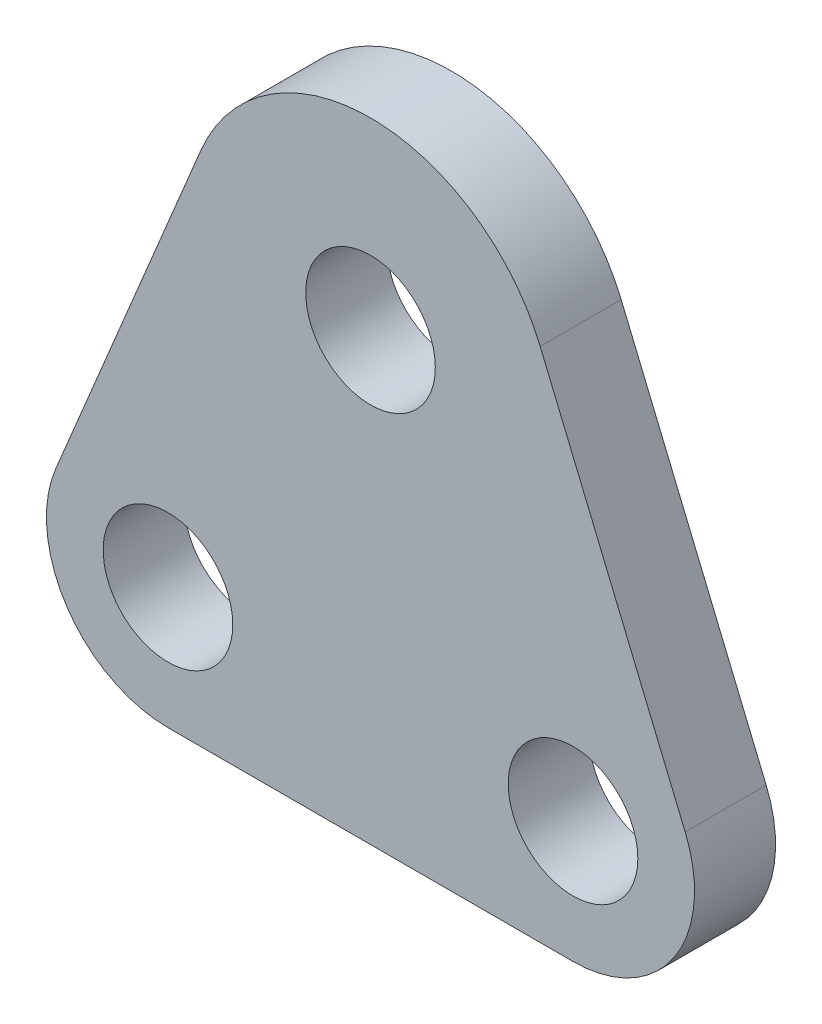
ISO-10303-21;
HEADER;
FILE_DESCRIPTION(('STEP AP214'),'2;1');
FILE_NAME('part.step','',(''),(''),'','','');
FILE_SCHEMA(('AUTOMOTIVE_DESIGN { 1 0 10303 214 1 1 1 1 }'));
ENDSEC;
DATA;
#1=APPLICATION_CONTEXT('core data for automotive mechanical design processes');
#2=APPLICATION_PROTOCOL_DEFINITION('international standard','automotive_design',2000,#1);
#3=PRODUCT_CONTEXT('',#1,'mechanical');
#4=PRODUCT('Part','Part','',(#3));
#5=PRODUCT_RELATED_PRODUCT_CATEGORY('part','',(#4));
#6=PRODUCT_DEFINITION_FORMATION('','',#4);
#7=PRODUCT_DEFINITION_CONTEXT('part definition',#1,'design');
#8=PRODUCT_DEFINITION('design','',#6,#7);
#9=PRODUCT_DEFINITION_SHAPE('','',#8);
#10=(LENGTH_UNIT() NAMED_UNIT(*) SI_UNIT(.MILLI.,.METRE.));
#11=(NAMED_UNIT(*) PLANE_ANGLE_UNIT() SI_UNIT($,.RADIAN.));
#12=(NAMED_UNIT(*) SI_UNIT($,.STERADIAN.) SOLID_ANGLE_UNIT());
#13=UNCERTAINTY_MEASURE_WITH_UNIT(LENGTH_MEASURE(1.E-05),#10,'distance_accuracy_value','');
#14=(GEOMETRIC_REPRESENTATION_CONTEXT(3) GLOBAL_UNCERTAINTY_ASSIGNED_CONTEXT((#13)) GLOBAL_UNIT_ASSIGNED_CONTEXT((#10,
#11,#12)) REPRESENTATION_CONTEXT('',''));
#15=CARTESIAN_POINT('',(0.,0.,0.));
#16=DIRECTION('',(0.,0.,1.));
#17=DIRECTION('',(1.,0.,0.));
#18=AXIS2_PLACEMENT_3D('',#15,#16,#17);
#19=CARTESIAN_POINT('',(-2.76923086674543,1.15384591981093,2.));
#20=DIRECTION('',(0.923076955581812,-0.384615306603643,0.));
#21=DIRECTION('',(0.384615306603643,0.923076955581812,0.));
#22=AXIS2_PLACEMENT_3D('',#19,#20,#21);
#23=PLANE('',#22);
#24=DIRECTION('',(-0.384615306603643,-0.923076955581812,0.));
#25=VECTOR('',#24,1.);
#26=CARTESIAN_POINT('',(-2.76923086674543,1.15384591981093,0.));
#27=LINE('',#26,#25);
#28=CARTESIAN_POINT('',(0.810649863919962,9.74556171861556,0.));
#29=VERTEX_POINT('',#28);
#30=CARTESIAN_POINT('',(-2.76923086674543,1.15384591981093,0.));
#31=VERTEX_POINT('',#30);
#32=EDGE_CURVE('E129',#29,#31,#27,.T.);
#33=ORIENTED_EDGE('',*,*,#32,.T.);
#34=DIRECTION('',(0.,0.,-1.));
#35=VECTOR('',#34,1.);
#36=CARTESIAN_POINT('',(-2.76923086674543,1.15384591981093,2.));
#37=LINE('',#36,#35);
#38=CARTESIAN_POINT('',(-2.76923086674543,1.15384591981093,2.));
#39=VERTEX_POINT('',#38);
#40=EDGE_CURVE('E11',#39,#31,#37,.T.);
#41=ORIENTED_EDGE('',*,*,#40,.F.);
#42=DIRECTION('',(-0.384615306603643,-0.923076955581812,0.));
#43=VECTOR('',#42,1.);
#44=CARTESIAN_POINT('',(-2.76923086674543,1.15384591981093,2.));
#45=LINE('',#44,#43);
#46=CARTESIAN_POINT('',(0.810649863919962,9.74556171861556,2.));
#47=VERTEX_POINT('',#46);
#48=EDGE_CURVE('E153',#47,#39,#45,.T.);
#49=ORIENTED_EDGE('',*,*,#48,.F.);
#50=DIRECTION('',(0.,0.,-1.));
#51=VECTOR('',#50,1.);
#52=CARTESIAN_POINT('',(0.810649863919962,9.74556171861556,2.));
#53=LINE('',#52,#51);
#54=EDGE_CURVE('E116',#47,#29,#53,.T.);
#55=ORIENTED_EDGE('',*,*,#54,.T.);
#56=EDGE_LOOP('',(#33,#41,#49,#55));
#57=FACE_BOUND('',#56,.T.);
#58=ADVANCED_FACE('F36',(#57),#23,.F.);
#59=CARTESIAN_POINT('',(0.,0.,2.));
#60=DIRECTION('',(0.,0.,-1.));
#61=DIRECTION('',(-1.,0.,0.));
#62=AXIS2_PLACEMENT_3D('',#59,#60,#61);
#63=CYLINDRICAL_SURFACE('',#62,3.);
#64=CARTESIAN_POINT('',(0.,0.,0.));
#65=DIRECTION('',(0.,0.,1.));
#66=DIRECTION('',(1.,0.,0.));
#67=AXIS2_PLACEMENT_3D('',#64,#65,#66);
#68=CIRCLE('',#67,3.);
#69=CARTESIAN_POINT('',(0.,-3.,0.));
#70=VERTEX_POINT('',#69);
#71=EDGE_CURVE('E132',#31,#70,#68,.T.);
#72=ORIENTED_EDGE('',*,*,#71,.T.);
#73=DIRECTION('',(0.,0.,-1.));
#74=VECTOR('',#73,1.);
#75=CARTESIAN_POINT('',(0.,-3.,2.));
#76=LINE('',#75,#74);
#77=CARTESIAN_POINT('',(0.,-3.,2.));
#78=VERTEX_POINT('',#77);
#79=EDGE_CURVE('E45',#78,#70,#76,.T.);
#80=ORIENTED_EDGE('',*,*,#79,.F.);
#81=CARTESIAN_POINT('',(0.,0.,2.));
#82=DIRECTION('',(0.,0.,1.));
#83=DIRECTION('',(1.,0.,0.));
#84=AXIS2_PLACEMENT_3D('',#81,#82,#83);
#85=CIRCLE('',#84,3.);
#86=EDGE_CURVE('E86',#39,#78,#85,.T.);
#87=ORIENTED_EDGE('',*,*,#86,.F.);
#88=ORIENTED_EDGE('',*,*,#40,.T.);
#89=EDGE_LOOP('',(#72,#80,#87,#88));
#90=FACE_BOUND('',#89,.T.);
#91=ADVANCED_FACE('F168',(#90),#63,.T.);
#92=CARTESIAN_POINT('',(0.,-3.,2.));
#93=DIRECTION('',(0.,1.,0.));
#94=DIRECTION('',(0.,0.,1.));
#95=AXIS2_PLACEMENT_3D('',#92,#93,#94);
#96=PLANE('',#95);
#97=DIRECTION('',(1.,0.,0.));
#98=VECTOR('',#97,1.);
#99=CARTESIAN_POINT('',(0.,-3.,0.));
#100=LINE('',#99,#98);
#101=CARTESIAN_POINT('',(9.99999797169469,-3.,0.));
#102=VERTEX_POINT('',#101);
#103=EDGE_CURVE('E134',#70,#102,#100,.T.);
#104=ORIENTED_EDGE('',*,*,#103,.T.);
#105=DIRECTION('',(0.,0.,-1.));
#106=VECTOR('',#105,1.);
#107=CARTESIAN_POINT('',(9.99999797169469,-3.,2.));
#108=LINE('',#107,#106);
#109=CARTESIAN_POINT('',(9.99999797169469,-3.,2.));
#110=VERTEX_POINT('',#109);
#111=EDGE_CURVE('E112',#110,#102,#108,.T.);
#112=ORIENTED_EDGE('',*,*,#111,.F.);
#113=DIRECTION('',(1.,0.,0.));
#114=VECTOR('',#113,1.);
#115=CARTESIAN_POINT('',(0.,-3.,2.));
#116=LINE('',#115,#114);
#117=EDGE_CURVE('E99',#78,#110,#116,.T.);
#118=ORIENTED_EDGE('',*,*,#117,.F.);
#119=ORIENTED_EDGE('',*,*,#79,.T.);
#120=EDGE_LOOP('',(#104,#112,#118,#119));
#121=FACE_BOUND('',#120,.T.);
#122=ADVANCED_FACE('F146',(#121),#96,.F.);
#123=CARTESIAN_POINT('',(9.99999797169469,0.,2.));
#124=DIRECTION('',(0.,0.,-1.));
#125=DIRECTION('',(-1.,0.,0.));
#126=AXIS2_PLACEMENT_3D('',#123,#124,#125);
#127=CYLINDRICAL_SURFACE('',#126,3.);
#128=CARTESIAN_POINT('',(9.99999797169469,0.,0.));
#129=DIRECTION('',(0.,0.,1.));
#130=DIRECTION('',(1.,0.,0.));
#131=AXIS2_PLACEMENT_3D('',#128,#129,#130);
#132=CIRCLE('',#131,3.);
#133=CARTESIAN_POINT('',(12.7692288384401,1.15384591981093,0.));
#134=VERTEX_POINT('',#133);
#135=EDGE_CURVE('E108',#102,#134,#132,.T.);
#136=ORIENTED_EDGE('',*,*,#135,.T.);
#137=DIRECTION('',(0.,0.,-1.));
#138=VECTOR('',#137,1.);
#139=CARTESIAN_POINT('',(12.7692288384401,1.15384591981093,2.));
#140=LINE('',#139,#138);
#141=CARTESIAN_POINT('',(12.7692288384401,1.15384591981093,2.));
#142=VERTEX_POINT('',#141);
#143=EDGE_CURVE('E105',#142,#134,#140,.T.);
#144=ORIENTED_EDGE('',*,*,#143,.F.);
#145=CARTESIAN_POINT('',(9.99999797169469,0.,2.));
#146=DIRECTION('',(0.,0.,1.));
#147=DIRECTION('',(1.,0.,0.));
#148=AXIS2_PLACEMENT_3D('',#145,#146,#147);
#149=CIRCLE('',#148,3.);
#150=EDGE_CURVE('E93',#110,#142,#149,.T.);
#151=ORIENTED_EDGE('',*,*,#150,.F.);
#152=ORIENTED_EDGE('',*,*,#111,.T.);
#153=EDGE_LOOP('',(#136,#144,#151,#152));
#154=FACE_BOUND('',#153,.T.);
#155=ADVANCED_FACE('F106',(#154),#127,.T.);
#156=CARTESIAN_POINT('',(11.289939797747,4.70414046260122,2.));
#157=DIRECTION('',(0.923076955581811,0.384615306603644,0.));
#158=DIRECTION('',(-0.384615306603644,0.923076955581811,0.));
#159=AXIS2_PLACEMENT_3D('',#156,#157,#158);
#160=PLANE('',#159);
#161=DIRECTION('',(0.384615306603644,-0.923076955581811,0.));
#162=VECTOR('',#161,1.);
#163=CARTESIAN_POINT('',(11.289939797747,4.70414046260122,0.));
#164=LINE('',#163,#162);
#165=CARTESIAN_POINT('',(9.18934810777472,9.74556171861555,0.));
#166=VERTEX_POINT('',#165);
#167=EDGE_CURVE('E137',#166,#134,#164,.T.);
#168=ORIENTED_EDGE('',*,*,#167,.F.);
#169=DIRECTION('',(0.,0.,-1.));
#170=VECTOR('',#169,1.);
#171=CARTESIAN_POINT('',(9.18934810777472,9.74556171861555,2.));
#172=LINE('',#171,#170);
#173=CARTESIAN_POINT('',(9.18934810777472,9.74556171861555,2.));
#174=VERTEX_POINT('',#173);
#175=EDGE_CURVE('E75',#174,#166,#172,.T.);
#176=ORIENTED_EDGE('',*,*,#175,.F.);
#177=DIRECTION('',(0.384615306603644,-0.923076955581811,0.));
#178=VECTOR('',#177,1.);
#179=CARTESIAN_POINT('',(11.289939797747,4.70414046260122,2.));
#180=LINE('',#179,#178);
#181=EDGE_CURVE('E97',#174,#142,#180,.T.);
#182=ORIENTED_EDGE('',*,*,#181,.T.);
#183=ORIENTED_EDGE('',*,*,#143,.T.);
#184=EDGE_LOOP('',(#168,#176,#182,#183));
#185=FACE_BOUND('',#184,.T.);
#186=ADVANCED_FACE('F114',(#185),#160,.T.);
#187=CARTESIAN_POINT('',(0.,0.,2.));
#188=DIRECTION('',(0.,0.,-1.));
#189=DIRECTION('',(-1.,0.,0.));
#190=AXIS2_PLACEMENT_3D('',#187,#188,#189);
#191=CYLINDRICAL_SURFACE('',#190,1.6);
#192=CARTESIAN_POINT('',(0.,0.,2.));
#193=DIRECTION('',(0.,0.,1.));
#194=DIRECTION('',(1.,0.,0.));
#195=AXIS2_PLACEMENT_3D('',#192,#193,#194);
#196=CIRCLE('',#195,1.6);
#197=CARTESIAN_POINT('',(1.6,0.,2.));
#198=VERTEX_POINT('',#197);
#199=EDGE_CURVE('E261',#198,#198,#196,.T.);
#200=ORIENTED_EDGE('',*,*,#199,.T.);
#201=EDGE_LOOP('',(#200));
#202=FACE_BOUND('',#201,.T.);
#203=CARTESIAN_POINT('',(0.,0.,0.));
#204=DIRECTION('',(0.,0.,1.));
#205=DIRECTION('',(1.,0.,0.));
#206=AXIS2_PLACEMENT_3D('',#203,#204,#205);
#207=CIRCLE('',#206,1.6);
#208=CARTESIAN_POINT('',(1.6,0.,0.));
#209=VERTEX_POINT('',#208);
#210=EDGE_CURVE('E126',#209,#209,#207,.T.);
#211=ORIENTED_EDGE('',*,*,#210,.F.);
#212=EDGE_LOOP('',(#211));
#213=FACE_BOUND('',#212,.T.);
#214=ADVANCED_FACE('F176',(#202,#213),#191,.F.);
#215=CARTESIAN_POINT('',(4.99999898584734,8.,2.));
#216=DIRECTION('',(0.,0.,-1.));
#217=DIRECTION('',(-1.,0.,0.));
#218=AXIS2_PLACEMENT_3D('',#215,#216,#217);
#219=CYLINDRICAL_SURFACE('',#218,1.6);
#220=CARTESIAN_POINT('',(4.99999898584734,8.,2.));
#221=DIRECTION('',(0.,0.,1.));
#222=DIRECTION('',(1.,0.,0.));
#223=AXIS2_PLACEMENT_3D('',#220,#221,#222);
#224=CIRCLE('',#223,1.6);
#225=CARTESIAN_POINT('',(6.59999898584734,8.,2.));
#226=VERTEX_POINT('',#225);
#227=EDGE_CURVE('E186',#226,#226,#224,.T.);
#228=ORIENTED_EDGE('',*,*,#227,.T.);
#229=EDGE_LOOP('',(#228));
#230=FACE_BOUND('',#229,.T.);
#231=CARTESIAN_POINT('',(4.99999898584734,8.,0.));
#232=DIRECTION('',(0.,0.,1.));
#233=DIRECTION('',(1.,0.,0.));
#234=AXIS2_PLACEMENT_3D('',#231,#232,#233);
#235=CIRCLE('',#234,1.6);
#236=CARTESIAN_POINT('',(6.59999898584734,8.,0.));
#237=VERTEX_POINT('',#236);
#238=EDGE_CURVE('E123',#237,#237,#235,.T.);
#239=ORIENTED_EDGE('',*,*,#238,.F.);
#240=EDGE_LOOP('',(#239));
#241=FACE_BOUND('',#240,.T.);
#242=ADVANCED_FACE('F163',(#230,#241),#219,.F.);
#243=CARTESIAN_POINT('',(9.99999797169469,0.,2.));
#244=DIRECTION('',(0.,0.,-1.));
#245=DIRECTION('',(-1.,0.,0.));
#246=AXIS2_PLACEMENT_3D('',#243,#244,#245);
#247=CYLINDRICAL_SURFACE('',#246,1.6);
#248=CARTESIAN_POINT('',(9.99999797169469,0.,2.));
#249=DIRECTION('',(0.,0.,1.));
#250=DIRECTION('',(1.,0.,0.));
#251=AXIS2_PLACEMENT_3D('',#248,#249,#250);
#252=CIRCLE('',#251,1.6);
#253=CARTESIAN_POINT('',(11.5999979716947,0.,2.));
#254=VERTEX_POINT('',#253);
#255=EDGE_CURVE('E140',#254,#254,#252,.T.);
#256=ORIENTED_EDGE('',*,*,#255,.T.);
#257=EDGE_LOOP('',(#256));
#258=FACE_BOUND('',#257,.T.);
#259=CARTESIAN_POINT('',(9.99999797169469,0.,0.));
#260=DIRECTION('',(0.,0.,1.));
#261=DIRECTION('',(1.,0.,0.));
#262=AXIS2_PLACEMENT_3D('',#259,#260,#261);
#263=CIRCLE('',#262,1.6);
#264=CARTESIAN_POINT('',(11.5999979716947,0.,0.));
#265=VERTEX_POINT('',#264);
#266=EDGE_CURVE('E120',#265,#265,#263,.T.);
#267=ORIENTED_EDGE('',*,*,#266,.F.);
#268=EDGE_LOOP('',(#267));
#269=FACE_BOUND('',#268,.T.);
#270=ADVANCED_FACE('F38',(#258,#269),#247,.F.);
#271=CARTESIAN_POINT('',(4.99999898584734,8.,2.));
#272=DIRECTION('',(0.,0.,-1.));
#273=DIRECTION('',(-1.,0.,0.));
#274=AXIS2_PLACEMENT_3D('',#271,#272,#273);
#275=CYLINDRICAL_SURFACE('',#274,4.53846138893897);
#276=CARTESIAN_POINT('',(4.99999898584734,8.,0.));
#277=DIRECTION('',(0.,0.,1.));
#278=DIRECTION('',(1.,0.,0.));
#279=AXIS2_PLACEMENT_3D('',#276,#277,#278);
#280=CIRCLE('',#279,4.53846138893897);
#281=EDGE_CURVE('E78',#166,#29,#280,.T.);
#282=ORIENTED_EDGE('',*,*,#281,.T.);
#283=ORIENTED_EDGE('',*,*,#54,.F.);
#284=CARTESIAN_POINT('',(4.99999898584734,8.,2.));
#285=DIRECTION('',(0.,0.,1.));
#286=DIRECTION('',(1.,0.,0.));
#287=AXIS2_PLACEMENT_3D('',#284,#285,#286);
#288=CIRCLE('',#287,4.53846138893897);
#289=EDGE_CURVE('E53',#174,#47,#288,.T.);
#290=ORIENTED_EDGE('',*,*,#289,.F.);
#291=ORIENTED_EDGE('',*,*,#175,.T.);
#292=EDGE_LOOP('',(#282,#283,#290,#291));
#293=FACE_BOUND('',#292,.T.);
#294=ADVANCED_FACE('F154',(#293),#275,.T.);
#295=CARTESIAN_POINT('',(0.,0.,2.));
#296=DIRECTION('',(0.,0.,1.));
#297=DIRECTION('',(1.,0.,0.));
#298=AXIS2_PLACEMENT_3D('',#295,#296,#297);
#299=PLANE('',#298);
#300=ORIENTED_EDGE('',*,*,#255,.F.);
#301=EDGE_LOOP('',(#300));
#302=FACE_BOUND('',#301,.T.);
#303=ORIENTED_EDGE('',*,*,#227,.F.);
#304=EDGE_LOOP('',(#303));
#305=FACE_BOUND('',#304,.T.);
#306=ORIENTED_EDGE('',*,*,#199,.F.);
#307=EDGE_LOOP('',(#306));
#308=FACE_BOUND('',#307,.T.);
#309=ORIENTED_EDGE('',*,*,#48,.T.);
#310=ORIENTED_EDGE('',*,*,#86,.T.);
#311=ORIENTED_EDGE('',*,*,#117,.T.);
#312=ORIENTED_EDGE('',*,*,#150,.T.);
#313=ORIENTED_EDGE('',*,*,#181,.F.);
#314=ORIENTED_EDGE('',*,*,#289,.T.);
#315=EDGE_LOOP('',(#309,#310,#311,#312,#313,#314));
#316=FACE_BOUND('',#315,.T.);
#317=ADVANCED_FACE('F95',(#302,#305,#308,#316),#299,.T.);
#318=CARTESIAN_POINT('',(0.,0.,0.));
#319=DIRECTION('',(0.,0.,1.));
#320=DIRECTION('',(1.,0.,0.));
#321=AXIS2_PLACEMENT_3D('',#318,#319,#320);
#322=PLANE('',#321);
#323=ORIENTED_EDGE('',*,*,#266,.T.);
#324=EDGE_LOOP('',(#323));
#325=FACE_BOUND('',#324,.T.);
#326=ORIENTED_EDGE('',*,*,#238,.T.);
#327=EDGE_LOOP('',(#326));
#328=FACE_BOUND('',#327,.T.);
#329=ORIENTED_EDGE('',*,*,#210,.T.);
#330=EDGE_LOOP('',(#329));
#331=FACE_BOUND('',#330,.T.);
#332=ORIENTED_EDGE('',*,*,#32,.F.);
#333=ORIENTED_EDGE('',*,*,#281,.F.);
#334=ORIENTED_EDGE('',*,*,#167,.T.);
#335=ORIENTED_EDGE('',*,*,#135,.F.);
#336=ORIENTED_EDGE('',*,*,#103,.F.);
#337=ORIENTED_EDGE('',*,*,#71,.F.);
#338=EDGE_LOOP('',(#332,#333,#334,#335,#336,#337));
#339=FACE_BOUND('',#338,.T.);
#340=ADVANCED_FACE('F149',(#325,#328,#331,#339),#322,.F.);
#341=CLOSED_SHELL('',(#58,#91,#122,#155,#186,#214,#242,#270,#294,#317,#340));
#342=MANIFOLD_SOLID_BREP('B2',#341);
#343=ADVANCED_BREP_SHAPE_REPRESENTATION('',(#18,#342),#14);
#344=SHAPE_DEFINITION_REPRESENTATION(#9,#343);
ENDSEC;
END-ISO-10303-21;
